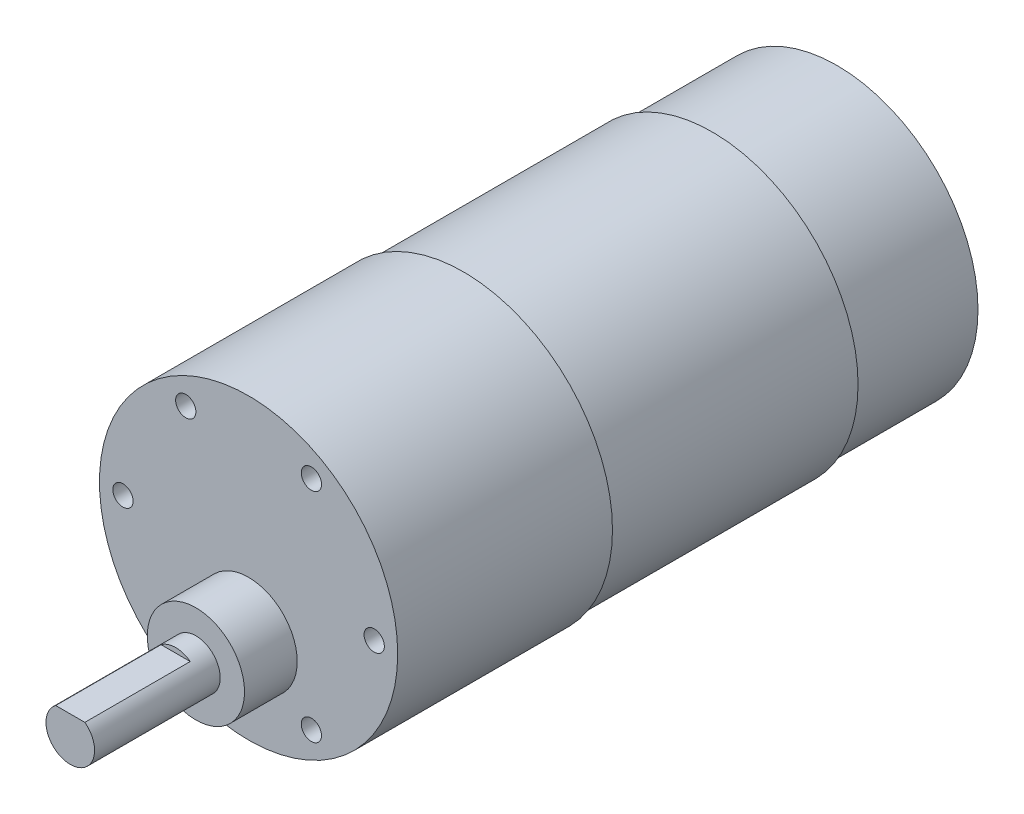
ISO-10303-21;
HEADER;
FILE_DESCRIPTION(('STEP AP214'),'2;1');
FILE_NAME('part.step','',(''),(''),'','','');
FILE_SCHEMA(('AUTOMOTIVE_DESIGN { 1 0 10303 214 1 1 1 1 }'));
ENDSEC;
DATA;
#1=APPLICATION_CONTEXT('core data for automotive mechanical design processes');
#2=APPLICATION_PROTOCOL_DEFINITION('international standard','automotive_design',2000,#1);
#3=PRODUCT_CONTEXT('',#1,'mechanical');
#4=PRODUCT('Part','Part','',(#3));
#5=PRODUCT_RELATED_PRODUCT_CATEGORY('part','',(#4));
#6=PRODUCT_DEFINITION_FORMATION('','',#4);
#7=PRODUCT_DEFINITION_CONTEXT('part definition',#1,'design');
#8=PRODUCT_DEFINITION('design','',#6,#7);
#9=PRODUCT_DEFINITION_SHAPE('','',#8);
#10=(LENGTH_UNIT() NAMED_UNIT(*) SI_UNIT(.MILLI.,.METRE.));
#11=(NAMED_UNIT(*) PLANE_ANGLE_UNIT() SI_UNIT($,.RADIAN.));
#12=(NAMED_UNIT(*) SI_UNIT($,.STERADIAN.) SOLID_ANGLE_UNIT());
#13=UNCERTAINTY_MEASURE_WITH_UNIT(LENGTH_MEASURE(1.E-05),#10,'distance_accuracy_value','');
#14=(GEOMETRIC_REPRESENTATION_CONTEXT(3) GLOBAL_UNCERTAINTY_ASSIGNED_CONTEXT((#13)) GLOBAL_UNIT_ASSIGNED_CONTEXT((#10,
#11,#12)) REPRESENTATION_CONTEXT('',''));
#15=CARTESIAN_POINT('',(0.,0.,0.));
#16=DIRECTION('',(0.,0.,1.));
#17=DIRECTION('',(1.,0.,0.));
#18=AXIS2_PLACEMENT_3D('',#15,#16,#17);
#19=CARTESIAN_POINT('',(0.,0.,15.4));
#20=DIRECTION('',(0.,0.,-1.));
#21=DIRECTION('',(-1.,0.,0.));
#22=AXIS2_PLACEMENT_3D('',#19,#20,#21);
#23=CYLINDRICAL_SURFACE('',#22,17.4);
#24=CARTESIAN_POINT('',(0.,0.,15.4));
#25=DIRECTION('',(0.,0.,1.));
#26=DIRECTION('',(1.,0.,0.));
#27=AXIS2_PLACEMENT_3D('',#24,#25,#26);
#28=CIRCLE('',#27,17.4);
#29=CARTESIAN_POINT('',(17.4,0.,15.4));
#30=VERTEX_POINT('',#29);
#31=EDGE_CURVE('E11',#30,#30,#28,.T.);
#32=ORIENTED_EDGE('',*,*,#31,.F.);
#33=EDGE_LOOP('',(#32));
#34=FACE_BOUND('',#33,.T.);
#35=CARTESIAN_POINT('',(0.,0.,0.));
#36=DIRECTION('',(0.,0.,1.));
#37=DIRECTION('',(1.,0.,0.));
#38=AXIS2_PLACEMENT_3D('',#35,#36,#37);
#39=CIRCLE('',#38,17.4);
#40=CARTESIAN_POINT('',(17.4,0.,0.));
#41=VERTEX_POINT('',#40);
#42=EDGE_CURVE('E37',#41,#41,#39,.T.);
#43=ORIENTED_EDGE('',*,*,#42,.T.);
#44=EDGE_LOOP('',(#43));
#45=FACE_BOUND('',#44,.T.);
#46=ADVANCED_FACE('F34',(#34,#45),#23,.T.);
#47=CARTESIAN_POINT('',(0.,0.,0.));
#48=DIRECTION('',(0.,0.,1.));
#49=DIRECTION('',(1.,0.,0.));
#50=AXIS2_PLACEMENT_3D('',#47,#48,#49);
#51=PLANE('',#50);
#52=ORIENTED_EDGE('',*,*,#42,.F.);
#53=EDGE_LOOP('',(#52));
#54=FACE_BOUND('',#53,.T.);
#55=ADVANCED_FACE('F113',(#54),#51,.F.);
#56=CARTESIAN_POINT('',(0.,0.,46.1));
#57=DIRECTION('',(0.,0.,-1.));
#58=DIRECTION('',(-1.,0.,0.));
#59=AXIS2_PLACEMENT_3D('',#56,#57,#58);
#60=CYLINDRICAL_SURFACE('',#59,18.);
#61=CARTESIAN_POINT('',(0.,0.,46.1));
#62=DIRECTION('',(0.,0.,1.));
#63=DIRECTION('',(1.,0.,0.));
#64=AXIS2_PLACEMENT_3D('',#61,#62,#63);
#65=CIRCLE('',#64,18.);
#66=CARTESIAN_POINT('',(18.,0.,46.1));
#67=VERTEX_POINT('',#66);
#68=EDGE_CURVE('E93',#67,#67,#65,.T.);
#69=ORIENTED_EDGE('',*,*,#68,.F.);
#70=EDGE_LOOP('',(#69));
#71=FACE_BOUND('',#70,.T.);
#72=CARTESIAN_POINT('',(0.,0.,15.4));
#73=DIRECTION('',(0.,0.,1.));
#74=DIRECTION('',(1.,0.,0.));
#75=AXIS2_PLACEMENT_3D('',#72,#73,#74);
#76=CIRCLE('',#75,18.);
#77=CARTESIAN_POINT('',(18.,0.,15.4));
#78=VERTEX_POINT('',#77);
#79=EDGE_CURVE('E90',#78,#78,#76,.T.);
#80=ORIENTED_EDGE('',*,*,#79,.T.);
#81=EDGE_LOOP('',(#80));
#82=FACE_BOUND('',#81,.T.);
#83=ADVANCED_FACE('F99',(#71,#82),#60,.T.);
#84=CARTESIAN_POINT('',(0.,0.,15.4));
#85=DIRECTION('',(0.,0.,1.));
#86=DIRECTION('',(1.,0.,0.));
#87=AXIS2_PLACEMENT_3D('',#84,#85,#86);
#88=PLANE('',#87);
#89=ORIENTED_EDGE('',*,*,#31,.T.);
#90=EDGE_LOOP('',(#89));
#91=FACE_BOUND('',#90,.T.);
#92=ORIENTED_EDGE('',*,*,#79,.F.);
#93=EDGE_LOOP('',(#92));
#94=FACE_BOUND('',#93,.T.);
#95=ADVANCED_FACE('F101',(#91,#94),#88,.F.);
#96=CARTESIAN_POINT('',(0.,0.,72.6));
#97=DIRECTION('',(0.,0.,-1.));
#98=DIRECTION('',(-1.,0.,0.));
#99=AXIS2_PLACEMENT_3D('',#96,#97,#98);
#100=CYLINDRICAL_SURFACE('',#99,18.4);
#101=CARTESIAN_POINT('',(0.,0.,72.6));
#102=DIRECTION('',(0.,0.,1.));
#103=DIRECTION('',(1.,0.,0.));
#104=AXIS2_PLACEMENT_3D('',#101,#102,#103);
#105=CIRCLE('',#104,18.4);
#106=CARTESIAN_POINT('',(18.4,0.,72.6));
#107=VERTEX_POINT('',#106);
#108=EDGE_CURVE('E87',#107,#107,#105,.T.);
#109=ORIENTED_EDGE('',*,*,#108,.F.);
#110=EDGE_LOOP('',(#109));
#111=FACE_BOUND('',#110,.T.);
#112=CARTESIAN_POINT('',(0.,0.,46.1));
#113=DIRECTION('',(0.,0.,1.));
#114=DIRECTION('',(1.,0.,0.));
#115=AXIS2_PLACEMENT_3D('',#112,#113,#114);
#116=CIRCLE('',#115,18.4);
#117=CARTESIAN_POINT('',(18.4,0.,46.1));
#118=VERTEX_POINT('',#117);
#119=EDGE_CURVE('E85',#118,#118,#116,.T.);
#120=ORIENTED_EDGE('',*,*,#119,.T.);
#121=EDGE_LOOP('',(#120));
#122=FACE_BOUND('',#121,.T.);
#123=ADVANCED_FACE('F103',(#111,#122),#100,.T.);
#124=CARTESIAN_POINT('',(0.,0.,72.6));
#125=DIRECTION('',(0.,0.,1.));
#126=DIRECTION('',(1.,0.,0.));
#127=AXIS2_PLACEMENT_3D('',#124,#125,#126);
#128=PLANE('',#127);
#129=CARTESIAN_POINT('',(-15.5,0.,72.6));
#130=DIRECTION('',(0.,0.,1.));
#131=DIRECTION('',(1.,0.,0.));
#132=AXIS2_PLACEMENT_3D('',#129,#130,#131);
#133=CIRCLE('',#132,1.25);
#134=CARTESIAN_POINT('',(-14.25,0.,72.6));
#135=VERTEX_POINT('',#134);
#136=EDGE_CURVE('E345',#135,#135,#133,.T.);
#137=ORIENTED_EDGE('',*,*,#136,.F.);
#138=EDGE_LOOP('',(#137));
#139=FACE_BOUND('',#138,.T.);
#140=CARTESIAN_POINT('',(-7.74999999999997,13.4233937586588,72.6));
#141=DIRECTION('',(0.,0.,1.));
#142=DIRECTION('',(1.,0.,0.));
#143=AXIS2_PLACEMENT_3D('',#140,#141,#142);
#144=CIRCLE('',#143,1.25);
#145=CARTESIAN_POINT('',(-6.49999999999997,13.4233937586588,72.6));
#146=VERTEX_POINT('',#145);
#147=EDGE_CURVE('E347',#146,#146,#144,.T.);
#148=ORIENTED_EDGE('',*,*,#147,.F.);
#149=EDGE_LOOP('',(#148));
#150=FACE_BOUND('',#149,.T.);
#151=CARTESIAN_POINT('',(7.75000000000006,13.4233937586588,72.6));
#152=DIRECTION('',(0.,0.,1.));
#153=DIRECTION('',(1.,0.,0.));
#154=AXIS2_PLACEMENT_3D('',#151,#152,#153);
#155=CIRCLE('',#154,1.25);
#156=CARTESIAN_POINT('',(9.00000000000006,13.4233937586588,72.6));
#157=VERTEX_POINT('',#156);
#158=EDGE_CURVE('E355',#157,#157,#155,.T.);
#159=ORIENTED_EDGE('',*,*,#158,.F.);
#160=EDGE_LOOP('',(#159));
#161=FACE_BOUND('',#160,.T.);
#162=CARTESIAN_POINT('',(15.5,-1.08235921504137E-13,72.6));
#163=DIRECTION('',(0.,0.,1.));
#164=DIRECTION('',(1.,0.,0.));
#165=AXIS2_PLACEMENT_3D('',#162,#163,#164);
#166=CIRCLE('',#165,1.25);
#167=CARTESIAN_POINT('',(16.75,-1.08235921504137E-13,72.6));
#168=VERTEX_POINT('',#167);
#169=EDGE_CURVE('E361',#168,#168,#166,.T.);
#170=ORIENTED_EDGE('',*,*,#169,.F.);
#171=EDGE_LOOP('',(#170));
#172=FACE_BOUND('',#171,.T.);
#173=CARTESIAN_POINT('',(7.74999999999987,-13.4233937586589,72.6));
#174=DIRECTION('',(0.,0.,1.));
#175=DIRECTION('',(1.,0.,0.));
#176=AXIS2_PLACEMENT_3D('',#173,#174,#175);
#177=CIRCLE('',#176,1.25);
#178=CARTESIAN_POINT('',(8.99999999999987,-13.4233937586589,72.6));
#179=VERTEX_POINT('',#178);
#180=EDGE_CURVE('E367',#179,#179,#177,.T.);
#181=ORIENTED_EDGE('',*,*,#180,.F.);
#182=EDGE_LOOP('',(#181));
#183=FACE_BOUND('',#182,.T.);
#184=CARTESIAN_POINT('',(-7.75000000000016,-13.4233937586587,72.6));
#185=DIRECTION('',(0.,0.,1.));
#186=DIRECTION('',(1.,0.,0.));
#187=AXIS2_PLACEMENT_3D('',#184,#185,#186);
#188=CIRCLE('',#187,1.25);
#189=CARTESIAN_POINT('',(-6.50000000000016,-13.4233937586587,72.6));
#190=VERTEX_POINT('',#189);
#191=EDGE_CURVE('E373',#190,#190,#188,.T.);
#192=ORIENTED_EDGE('',*,*,#191,.F.);
#193=EDGE_LOOP('',(#192));
#194=FACE_BOUND('',#193,.T.);
#195=CARTESIAN_POINT('',(0.,-7.,72.6));
#196=DIRECTION('',(0.,0.,1.));
#197=DIRECTION('',(1.,0.,0.));
#198=AXIS2_PLACEMENT_3D('',#195,#196,#197);
#199=CIRCLE('',#198,6.);
#200=CARTESIAN_POINT('',(6.,-7.,72.6));
#201=VERTEX_POINT('',#200);
#202=EDGE_CURVE('E75',#201,#201,#199,.T.);
#203=ORIENTED_EDGE('',*,*,#202,.F.);
#204=EDGE_LOOP('',(#203));
#205=FACE_BOUND('',#204,.T.);
#206=ORIENTED_EDGE('',*,*,#108,.T.);
#207=EDGE_LOOP('',(#206));
#208=FACE_BOUND('',#207,.T.);
#209=ADVANCED_FACE('F110',(#139,#150,#161,#172,#183,#194,#205,#208),#128,.T.);
#210=CARTESIAN_POINT('',(0.,0.,46.1));
#211=DIRECTION('',(0.,0.,1.));
#212=DIRECTION('',(1.,0.,0.));
#213=AXIS2_PLACEMENT_3D('',#210,#211,#212);
#214=PLANE('',#213);
#215=ORIENTED_EDGE('',*,*,#68,.T.);
#216=EDGE_LOOP('',(#215));
#217=FACE_BOUND('',#216,.T.);
#218=ORIENTED_EDGE('',*,*,#119,.F.);
#219=EDGE_LOOP('',(#218));
#220=FACE_BOUND('',#219,.T.);
#221=ADVANCED_FACE('F149',(#217,#220),#214,.F.);
#222=CARTESIAN_POINT('',(0.,-7.,79.1));
#223=DIRECTION('',(0.,0.,-1.));
#224=DIRECTION('',(-1.,0.,0.));
#225=AXIS2_PLACEMENT_3D('',#222,#223,#224);
#226=CYLINDRICAL_SURFACE('',#225,6.);
#227=CARTESIAN_POINT('',(0.,-7.,79.1));
#228=DIRECTION('',(0.,0.,1.));
#229=DIRECTION('',(1.,0.,0.));
#230=AXIS2_PLACEMENT_3D('',#227,#228,#229);
#231=CIRCLE('',#230,6.);
#232=CARTESIAN_POINT('',(6.,-7.,79.1));
#233=VERTEX_POINT('',#232);
#234=EDGE_CURVE('E78',#233,#233,#231,.T.);
#235=ORIENTED_EDGE('',*,*,#234,.F.);
#236=EDGE_LOOP('',(#235));
#237=FACE_BOUND('',#236,.T.);
#238=ORIENTED_EDGE('',*,*,#202,.T.);
#239=EDGE_LOOP('',(#238));
#240=FACE_BOUND('',#239,.T.);
#241=ADVANCED_FACE('F154',(#237,#240),#226,.T.);
#242=CARTESIAN_POINT('',(0.,-7.,79.1));
#243=DIRECTION('',(0.,0.,1.));
#244=DIRECTION('',(1.,0.,0.));
#245=AXIS2_PLACEMENT_3D('',#242,#243,#244);
#246=PLANE('',#245);
#247=CARTESIAN_POINT('',(0.,-7.,79.1));
#248=DIRECTION('',(0.,0.,1.));
#249=DIRECTION('',(1.,0.,0.));
#250=AXIS2_PLACEMENT_3D('',#247,#248,#249);
#251=CIRCLE('',#250,3.);
#252=CARTESIAN_POINT('',(3.,-7.,79.1));
#253=VERTEX_POINT('',#252);
#254=EDGE_CURVE('E72',#253,#253,#251,.T.);
#255=ORIENTED_EDGE('',*,*,#254,.F.);
#256=EDGE_LOOP('',(#255));
#257=FACE_BOUND('',#256,.T.);
#258=ORIENTED_EDGE('',*,*,#234,.T.);
#259=EDGE_LOOP('',(#258));
#260=FACE_BOUND('',#259,.T.);
#261=ADVANCED_FACE('F164',(#257,#260),#246,.T.);
#262=CARTESIAN_POINT('',(0.,-7.,94.6));
#263=DIRECTION('',(0.,0.,-1.));
#264=DIRECTION('',(-1.,0.,0.));
#265=AXIS2_PLACEMENT_3D('',#262,#263,#264);
#266=CYLINDRICAL_SURFACE('',#265,3.);
#267=CARTESIAN_POINT('',(0.,-7.,94.6));
#268=DIRECTION('',(0.,0.,1.));
#269=DIRECTION('',(1.,0.,0.));
#270=AXIS2_PLACEMENT_3D('',#267,#268,#269);
#271=CIRCLE('',#270,3.);
#272=CARTESIAN_POINT('',(-1.8,-4.6,94.6));
#273=VERTEX_POINT('',#272);
#274=CARTESIAN_POINT('',(1.8,-4.6,94.6));
#275=VERTEX_POINT('',#274);
#276=EDGE_CURVE('E71',#273,#275,#271,.T.);
#277=ORIENTED_EDGE('',*,*,#276,.F.);
#278=DIRECTION('',(0.,0.,1.));
#279=VECTOR('',#278,1.);
#280=CARTESIAN_POINT('',(-1.8,-4.6,81.6));
#281=LINE('',#280,#279);
#282=CARTESIAN_POINT('',(-1.8,-4.6,81.6));
#283=VERTEX_POINT('',#282);
#284=EDGE_CURVE('E48',#283,#273,#281,.T.);
#285=ORIENTED_EDGE('',*,*,#284,.F.);
#286=CARTESIAN_POINT('',(0.,-7.00000000000001,81.6));
#287=DIRECTION('',(0.,0.,1.));
#288=DIRECTION('',(-1.,0.,0.));
#289=AXIS2_PLACEMENT_3D('',#286,#287,#288);
#290=CIRCLE('',#289,3.00000000000001);
#291=CARTESIAN_POINT('',(1.8,-4.6,81.6));
#292=VERTEX_POINT('',#291);
#293=EDGE_CURVE('E64',#292,#283,#290,.T.);
#294=ORIENTED_EDGE('',*,*,#293,.F.);
#295=DIRECTION('',(0.,0.,1.));
#296=VECTOR('',#295,1.);
#297=CARTESIAN_POINT('',(1.8,-4.6,81.6));
#298=LINE('',#297,#296);
#299=EDGE_CURVE('E54',#292,#275,#298,.T.);
#300=ORIENTED_EDGE('',*,*,#299,.T.);
#301=EDGE_LOOP('',(#277,#285,#294,#300));
#302=FACE_BOUND('',#301,.T.);
#303=ORIENTED_EDGE('',*,*,#254,.T.);
#304=EDGE_LOOP('',(#303));
#305=FACE_BOUND('',#304,.T.);
#306=ADVANCED_FACE('F69',(#302,#305),#266,.T.);
#307=CARTESIAN_POINT('',(0.,-7.,94.6));
#308=DIRECTION('',(0.,0.,1.));
#309=DIRECTION('',(1.,0.,0.));
#310=AXIS2_PLACEMENT_3D('',#307,#308,#309);
#311=PLANE('',#310);
#312=DIRECTION('',(1.,0.,0.));
#313=VECTOR('',#312,1.);
#314=CARTESIAN_POINT('',(-1.8,-4.6,94.6));
#315=LINE('',#314,#313);
#316=EDGE_CURVE('E59',#273,#275,#315,.T.);
#317=ORIENTED_EDGE('',*,*,#316,.F.);
#318=ORIENTED_EDGE('',*,*,#276,.T.);
#319=EDGE_LOOP('',(#317,#318));
#320=FACE_BOUND('',#319,.T.);
#321=ADVANCED_FACE('F74',(#320),#311,.T.);
#322=CARTESIAN_POINT('',(-1.8,-4.6,81.6));
#323=DIRECTION('',(0.,-1.,0.));
#324=DIRECTION('',(0.,0.,-1.));
#325=AXIS2_PLACEMENT_3D('',#322,#323,#324);
#326=PLANE('',#325);
#327=ORIENTED_EDGE('',*,*,#316,.T.);
#328=ORIENTED_EDGE('',*,*,#299,.F.);
#329=DIRECTION('',(1.,0.,0.));
#330=VECTOR('',#329,1.);
#331=CARTESIAN_POINT('',(-1.8,-4.6,81.6));
#332=LINE('',#331,#330);
#333=EDGE_CURVE('E379',#283,#292,#332,.T.);
#334=ORIENTED_EDGE('',*,*,#333,.F.);
#335=ORIENTED_EDGE('',*,*,#284,.T.);
#336=EDGE_LOOP('',(#327,#328,#334,#335));
#337=FACE_BOUND('',#336,.T.);
#338=ADVANCED_FACE('F60',(#337),#326,.F.);
#339=CARTESIAN_POINT('',(0.,-7.00000000000001,81.6));
#340=DIRECTION('',(0.,0.,-1.));
#341=DIRECTION('',(-1.,0.,0.));
#342=AXIS2_PLACEMENT_3D('',#339,#340,#341);
#343=PLANE('',#342);
#344=ORIENTED_EDGE('',*,*,#293,.T.);
#345=ORIENTED_EDGE('',*,*,#333,.T.);
#346=EDGE_LOOP('',(#344,#345));
#347=FACE_BOUND('',#346,.T.);
#348=ADVANCED_FACE('F199',(#347),#343,.F.);
#349=CARTESIAN_POINT('',(-7.75000000000016,-13.4233937586587,61.84));
#350=DIRECTION('',(0.,0.,-1.));
#351=DIRECTION('',(-1.,0.,0.));
#352=AXIS2_PLACEMENT_3D('',#349,#350,#351);
#353=PLANE('',#352);
#354=CARTESIAN_POINT('',(-7.75000000000016,-13.4233937586587,61.84));
#355=DIRECTION('',(0.,0.,1.));
#356=DIRECTION('',(1.,0.,0.));
#357=AXIS2_PLACEMENT_3D('',#354,#355,#356);
#358=CIRCLE('',#357,1.25);
#359=CARTESIAN_POINT('',(-6.50000000000016,-13.4233937586587,61.84));
#360=VERTEX_POINT('',#359);
#361=EDGE_CURVE('E65',#360,#360,#358,.T.);
#362=ORIENTED_EDGE('',*,*,#361,.T.);
#363=EDGE_LOOP('',(#362));
#364=FACE_BOUND('',#363,.T.);
#365=ADVANCED_FACE('F208',(#364),#353,.F.);
#366=CARTESIAN_POINT('',(-7.75000000000016,-13.4233937586587,72.6));
#367=DIRECTION('',(0.,0.,1.));
#368=DIRECTION('',(1.,0.,0.));
#369=AXIS2_PLACEMENT_3D('',#366,#367,#368);
#370=CYLINDRICAL_SURFACE('',#369,1.25);
#371=ORIENTED_EDGE('',*,*,#361,.F.);
#372=EDGE_LOOP('',(#371));
#373=FACE_BOUND('',#372,.T.);
#374=ORIENTED_EDGE('',*,*,#191,.T.);
#375=EDGE_LOOP('',(#374));
#376=FACE_BOUND('',#375,.T.);
#377=ADVANCED_FACE('F225',(#373,#376),#370,.F.);
#378=CARTESIAN_POINT('',(7.74999999999987,-13.4233937586589,61.84));
#379=DIRECTION('',(0.,0.,-1.));
#380=DIRECTION('',(-1.,0.,0.));
#381=AXIS2_PLACEMENT_3D('',#378,#379,#380);
#382=PLANE('',#381);
#383=CARTESIAN_POINT('',(7.74999999999987,-13.4233937586589,61.84));
#384=DIRECTION('',(0.,0.,1.));
#385=DIRECTION('',(1.,0.,0.));
#386=AXIS2_PLACEMENT_3D('',#383,#384,#385);
#387=CIRCLE('',#386,1.25);
#388=CARTESIAN_POINT('',(8.99999999999987,-13.4233937586589,61.84));
#389=VERTEX_POINT('',#388);
#390=EDGE_CURVE('E370',#389,#389,#387,.T.);
#391=ORIENTED_EDGE('',*,*,#390,.T.);
#392=EDGE_LOOP('',(#391));
#393=FACE_BOUND('',#392,.T.);
#394=ADVANCED_FACE('F235',(#393),#382,.F.);
#395=CARTESIAN_POINT('',(7.74999999999987,-13.4233937586589,72.6));
#396=DIRECTION('',(0.,0.,1.));
#397=DIRECTION('',(1.,0.,0.));
#398=AXIS2_PLACEMENT_3D('',#395,#396,#397);
#399=CYLINDRICAL_SURFACE('',#398,1.25);
#400=ORIENTED_EDGE('',*,*,#390,.F.);
#401=EDGE_LOOP('',(#400));
#402=FACE_BOUND('',#401,.T.);
#403=ORIENTED_EDGE('',*,*,#180,.T.);
#404=EDGE_LOOP('',(#403));
#405=FACE_BOUND('',#404,.T.);
#406=ADVANCED_FACE('F245',(#402,#405),#399,.F.);
#407=CARTESIAN_POINT('',(15.5,-1.08235921504137E-13,61.84));
#408=DIRECTION('',(0.,0.,-1.));
#409=DIRECTION('',(-1.,0.,0.));
#410=AXIS2_PLACEMENT_3D('',#407,#408,#409);
#411=PLANE('',#410);
#412=CARTESIAN_POINT('',(15.5,-1.08235921504137E-13,61.84));
#413=DIRECTION('',(0.,0.,1.));
#414=DIRECTION('',(1.,0.,0.));
#415=AXIS2_PLACEMENT_3D('',#412,#413,#414);
#416=CIRCLE('',#415,1.25);
#417=CARTESIAN_POINT('',(16.75,-1.08235921504137E-13,61.84));
#418=VERTEX_POINT('',#417);
#419=EDGE_CURVE('E364',#418,#418,#416,.T.);
#420=ORIENTED_EDGE('',*,*,#419,.T.);
#421=EDGE_LOOP('',(#420));
#422=FACE_BOUND('',#421,.T.);
#423=ADVANCED_FACE('F255',(#422),#411,.F.);
#424=CARTESIAN_POINT('',(15.5,-1.08235921504137E-13,72.6));
#425=DIRECTION('',(0.,0.,1.));
#426=DIRECTION('',(1.,0.,0.));
#427=AXIS2_PLACEMENT_3D('',#424,#425,#426);
#428=CYLINDRICAL_SURFACE('',#427,1.25);
#429=ORIENTED_EDGE('',*,*,#419,.F.);
#430=EDGE_LOOP('',(#429));
#431=FACE_BOUND('',#430,.T.);
#432=ORIENTED_EDGE('',*,*,#169,.T.);
#433=EDGE_LOOP('',(#432));
#434=FACE_BOUND('',#433,.T.);
#435=ADVANCED_FACE('F265',(#431,#434),#428,.F.);
#436=CARTESIAN_POINT('',(7.75000000000006,13.4233937586588,61.84));
#437=DIRECTION('',(0.,0.,-1.));
#438=DIRECTION('',(-1.,0.,0.));
#439=AXIS2_PLACEMENT_3D('',#436,#437,#438);
#440=PLANE('',#439);
#441=CARTESIAN_POINT('',(7.75000000000006,13.4233937586588,61.84));
#442=DIRECTION('',(0.,0.,1.));
#443=DIRECTION('',(1.,0.,0.));
#444=AXIS2_PLACEMENT_3D('',#441,#442,#443);
#445=CIRCLE('',#444,1.25);
#446=CARTESIAN_POINT('',(9.00000000000006,13.4233937586588,61.84));
#447=VERTEX_POINT('',#446);
#448=EDGE_CURVE('E358',#447,#447,#445,.T.);
#449=ORIENTED_EDGE('',*,*,#448,.T.);
#450=EDGE_LOOP('',(#449));
#451=FACE_BOUND('',#450,.T.);
#452=ADVANCED_FACE('F275',(#451),#440,.F.);
#453=CARTESIAN_POINT('',(7.75000000000006,13.4233937586588,72.6));
#454=DIRECTION('',(0.,0.,1.));
#455=DIRECTION('',(1.,0.,0.));
#456=AXIS2_PLACEMENT_3D('',#453,#454,#455);
#457=CYLINDRICAL_SURFACE('',#456,1.25);
#458=ORIENTED_EDGE('',*,*,#448,.F.);
#459=EDGE_LOOP('',(#458));
#460=FACE_BOUND('',#459,.T.);
#461=ORIENTED_EDGE('',*,*,#158,.T.);
#462=EDGE_LOOP('',(#461));
#463=FACE_BOUND('',#462,.T.);
#464=ADVANCED_FACE('F285',(#460,#463),#457,.F.);
#465=CARTESIAN_POINT('',(-7.74999999999997,13.4233937586588,61.84));
#466=DIRECTION('',(0.,0.,-1.));
#467=DIRECTION('',(-1.,0.,0.));
#468=AXIS2_PLACEMENT_3D('',#465,#466,#467);
#469=PLANE('',#468);
#470=CARTESIAN_POINT('',(-7.74999999999997,13.4233937586588,61.84));
#471=DIRECTION('',(0.,0.,1.));
#472=DIRECTION('',(1.,0.,0.));
#473=AXIS2_PLACEMENT_3D('',#470,#471,#472);
#474=CIRCLE('',#473,1.25);
#475=CARTESIAN_POINT('',(-6.49999999999997,13.4233937586588,61.84));
#476=VERTEX_POINT('',#475);
#477=EDGE_CURVE('E352',#476,#476,#474,.T.);
#478=ORIENTED_EDGE('',*,*,#477,.T.);
#479=EDGE_LOOP('',(#478));
#480=FACE_BOUND('',#479,.T.);
#481=ADVANCED_FACE('F295',(#480),#469,.F.);
#482=CARTESIAN_POINT('',(-7.74999999999997,13.4233937586588,72.6));
#483=DIRECTION('',(0.,0.,1.));
#484=DIRECTION('',(1.,0.,0.));
#485=AXIS2_PLACEMENT_3D('',#482,#483,#484);
#486=CYLINDRICAL_SURFACE('',#485,1.25);
#487=ORIENTED_EDGE('',*,*,#477,.F.);
#488=EDGE_LOOP('',(#487));
#489=FACE_BOUND('',#488,.T.);
#490=ORIENTED_EDGE('',*,*,#147,.T.);
#491=EDGE_LOOP('',(#490));
#492=FACE_BOUND('',#491,.T.);
#493=ADVANCED_FACE('F305',(#489,#492),#486,.F.);
#494=CARTESIAN_POINT('',(-15.5,0.,61.84));
#495=DIRECTION('',(0.,0.,-1.));
#496=DIRECTION('',(-1.,0.,0.));
#497=AXIS2_PLACEMENT_3D('',#494,#495,#496);
#498=PLANE('',#497);
#499=CARTESIAN_POINT('',(-15.5,0.,61.84));
#500=DIRECTION('',(0.,0.,1.));
#501=DIRECTION('',(1.,0.,0.));
#502=AXIS2_PLACEMENT_3D('',#499,#500,#501);
#503=CIRCLE('',#502,1.25);
#504=CARTESIAN_POINT('',(-14.25,0.,61.84));
#505=VERTEX_POINT('',#504);
#506=EDGE_CURVE('E342',#505,#505,#503,.T.);
#507=ORIENTED_EDGE('',*,*,#506,.T.);
#508=EDGE_LOOP('',(#507));
#509=FACE_BOUND('',#508,.T.);
#510=ADVANCED_FACE('F315',(#509),#498,.F.);
#511=CARTESIAN_POINT('',(-15.5,0.,72.6));
#512=DIRECTION('',(0.,0.,1.));
#513=DIRECTION('',(1.,0.,0.));
#514=AXIS2_PLACEMENT_3D('',#511,#512,#513);
#515=CYLINDRICAL_SURFACE('',#514,1.25);
#516=ORIENTED_EDGE('',*,*,#506,.F.);
#517=EDGE_LOOP('',(#516));
#518=FACE_BOUND('',#517,.T.);
#519=ORIENTED_EDGE('',*,*,#136,.T.);
#520=EDGE_LOOP('',(#519));
#521=FACE_BOUND('',#520,.T.);
#522=ADVANCED_FACE('F325',(#518,#521),#515,.F.);
#523=CLOSED_SHELL('',(#46,#55,#83,#95,#123,#209,#221,#241,#261,#306,#321,#338,#348,#365,#377,
#394,#406,#423,#435,#452,#464,#481,#493,#510,#522));
#524=MANIFOLD_SOLID_BREP('B2',#523);
#525=ADVANCED_BREP_SHAPE_REPRESENTATION('',(#18,#524),#14);
#526=SHAPE_DEFINITION_REPRESENTATION(#9,#525);
ENDSEC;
END-ISO-10303-21;
